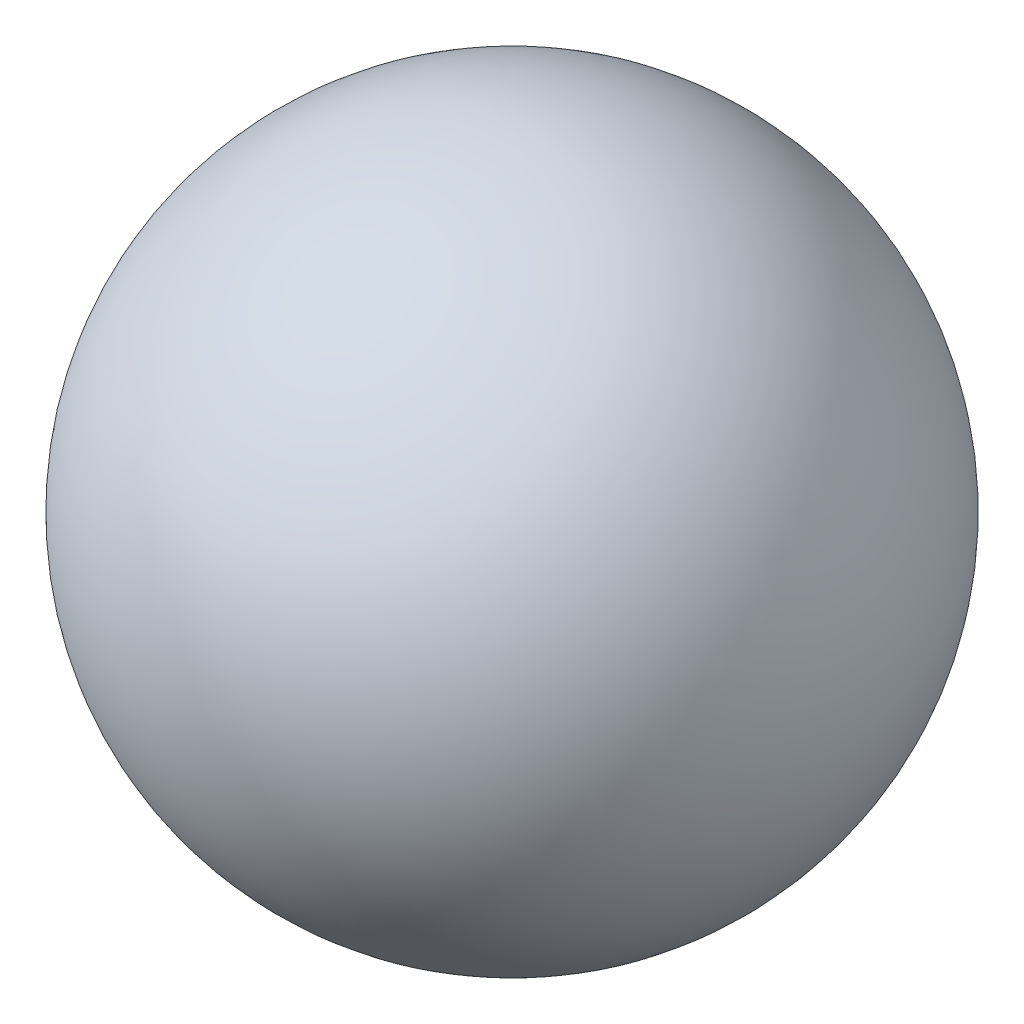
ISO-10303-21;
HEADER;
FILE_DESCRIPTION(('STEP AP214'),'2;1');
FILE_NAME('part.step','',(''),(''),'','','');
FILE_SCHEMA(('AUTOMOTIVE_DESIGN { 1 0 10303 214 1 1 1 1 }'));
ENDSEC;
DATA;
#1=APPLICATION_CONTEXT('core data for automotive mechanical design processes');
#2=APPLICATION_PROTOCOL_DEFINITION('international standard','automotive_design',2000,#1);
#3=PRODUCT_CONTEXT('',#1,'mechanical');
#4=PRODUCT('Part','Part','',(#3));
#5=PRODUCT_RELATED_PRODUCT_CATEGORY('part','',(#4));
#6=PRODUCT_DEFINITION_FORMATION('','',#4);
#7=PRODUCT_DEFINITION_CONTEXT('part definition',#1,'design');
#8=PRODUCT_DEFINITION('design','',#6,#7);
#9=PRODUCT_DEFINITION_SHAPE('','',#8);
#10=(LENGTH_UNIT() NAMED_UNIT(*) SI_UNIT(.MILLI.,.METRE.));
#11=(NAMED_UNIT(*) PLANE_ANGLE_UNIT() SI_UNIT($,.RADIAN.));
#12=(NAMED_UNIT(*) SI_UNIT($,.STERADIAN.) SOLID_ANGLE_UNIT());
#13=UNCERTAINTY_MEASURE_WITH_UNIT(LENGTH_MEASURE(1.E-05),#10,'distance_accuracy_value','');
#14=(GEOMETRIC_REPRESENTATION_CONTEXT(3) GLOBAL_UNCERTAINTY_ASSIGNED_CONTEXT((#13)) GLOBAL_UNIT_ASSIGNED_CONTEXT((#10,
#11,#12)) REPRESENTATION_CONTEXT('',''));
#15=CARTESIAN_POINT('',(0.,0.,0.));
#16=DIRECTION('',(0.,0.,1.));
#17=DIRECTION('',(1.,0.,0.));
#18=AXIS2_PLACEMENT_3D('',#15,#16,#17);
#19=CARTESIAN_POINT('',(0.,0.,0.));
#20=DIRECTION('',(0.,1.,0.));
#21=DIRECTION('',(1.,0.,0.));
#22=AXIS2_PLACEMENT_3D('',#19,#20,#21);
#23=SPHERICAL_SURFACE('',#22,87.5839183555075);
#24=CARTESIAN_POINT('',(0.,87.5839183555075,0.));
#25=VERTEX_POINT('',#24);
#26=VERTEX_LOOP('',#25);
#27=FACE_BOUND('',#26,.T.);
#28=ADVANCED_FACE('F29',(#27),#23,.T.);
#29=CLOSED_SHELL('',(#28));
#30=MANIFOLD_SOLID_BREP('B2',#29);
#31=ADVANCED_BREP_SHAPE_REPRESENTATION('',(#18,#30),#14);
#32=SHAPE_DEFINITION_REPRESENTATION(#9,#31);
ENDSEC;
END-ISO-10303-21;
